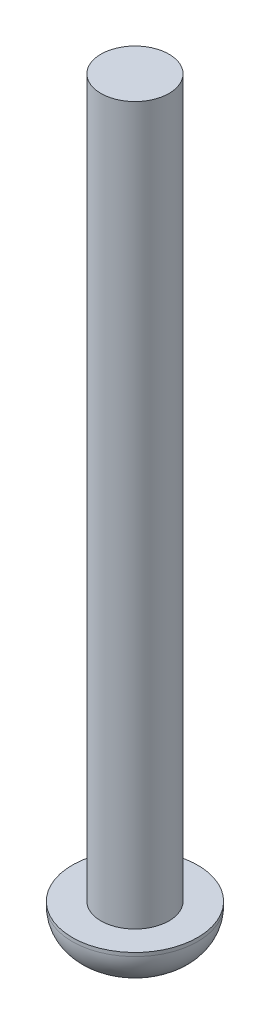
ISO-10303-21;
HEADER;
FILE_DESCRIPTION(('STEP AP214'),'2;1');
FILE_NAME('part.step','',(''),(''),'','','');
FILE_SCHEMA(('AUTOMOTIVE_DESIGN { 1 0 10303 214 1 1 1 1 }'));
ENDSEC;
DATA;
#1=APPLICATION_CONTEXT('core data for automotive mechanical design processes');
#2=APPLICATION_PROTOCOL_DEFINITION('international standard','automotive_design',2000,#1);
#3=PRODUCT_CONTEXT('',#1,'mechanical');
#4=PRODUCT('Part','Part','',(#3));
#5=PRODUCT_RELATED_PRODUCT_CATEGORY('part','',(#4));
#6=PRODUCT_DEFINITION_FORMATION('','',#4);
#7=PRODUCT_DEFINITION_CONTEXT('part definition',#1,'design');
#8=PRODUCT_DEFINITION('design','',#6,#7);
#9=PRODUCT_DEFINITION_SHAPE('','',#8);
#10=(LENGTH_UNIT() NAMED_UNIT(*) SI_UNIT(.MILLI.,.METRE.));
#11=(NAMED_UNIT(*) PLANE_ANGLE_UNIT() SI_UNIT($,.RADIAN.));
#12=(NAMED_UNIT(*) SI_UNIT($,.STERADIAN.) SOLID_ANGLE_UNIT());
#13=UNCERTAINTY_MEASURE_WITH_UNIT(LENGTH_MEASURE(1.E-05),#10,'distance_accuracy_value','');
#14=(GEOMETRIC_REPRESENTATION_CONTEXT(3) GLOBAL_UNCERTAINTY_ASSIGNED_CONTEXT((#13)) GLOBAL_UNIT_ASSIGNED_CONTEXT((#10,
#11,#12)) REPRESENTATION_CONTEXT('',''));
#15=CARTESIAN_POINT('',(0.,0.,0.));
#16=DIRECTION('',(0.,0.,1.));
#17=DIRECTION('',(1.,0.,0.));
#18=AXIS2_PLACEMENT_3D('',#15,#16,#17);
#19=CARTESIAN_POINT('',(0.,2.2,0.));
#20=DIRECTION('',(0.,-1.,0.));
#21=DIRECTION('',(0.,0.,-1.));
#22=AXIS2_PLACEMENT_3D('',#19,#20,#21);
#23=CYLINDRICAL_SURFACE('',#22,3.5);
#24=CARTESIAN_POINT('',(0.,2.,0.));
#25=DIRECTION('',(0.,1.,0.));
#26=DIRECTION('',(0.,0.,1.));
#27=AXIS2_PLACEMENT_3D('',#24,#25,#26);
#28=CIRCLE('',#27,3.5);
#29=CARTESIAN_POINT('',(0.,2.,3.5));
#30=VERTEX_POINT('',#29);
#31=EDGE_CURVE('E41',#30,#30,#28,.T.);
#32=ORIENTED_EDGE('',*,*,#31,.T.);
#33=EDGE_LOOP('',(#32));
#34=FACE_BOUND('',#33,.T.);
#35=CARTESIAN_POINT('',(0.,2.2,0.));
#36=DIRECTION('',(0.,1.,0.));
#37=DIRECTION('',(0.,0.,1.));
#38=AXIS2_PLACEMENT_3D('',#35,#36,#37);
#39=CIRCLE('',#38,3.5);
#40=CARTESIAN_POINT('',(0.,2.2,3.5));
#41=VERTEX_POINT('',#40);
#42=EDGE_CURVE('E49',#41,#41,#39,.T.);
#43=ORIENTED_EDGE('',*,*,#42,.F.);
#44=EDGE_LOOP('',(#43));
#45=FACE_BOUND('',#44,.T.);
#46=ADVANCED_FACE('F34',(#34,#45),#23,.T.);
#47=CARTESIAN_POINT('',(0.,2.2,0.));
#48=DIRECTION('',(0.,1.,0.));
#49=DIRECTION('',(0.,0.,1.));
#50=AXIS2_PLACEMENT_3D('',#47,#48,#49);
#51=PLANE('',#50);
#52=CARTESIAN_POINT('',(0.,2.2,0.));
#53=DIRECTION('',(0.,1.,0.));
#54=DIRECTION('',(0.,0.,1.));
#55=AXIS2_PLACEMENT_3D('',#52,#53,#54);
#56=CIRCLE('',#55,1.9);
#57=CARTESIAN_POINT('',(0.,2.2,1.9));
#58=VERTEX_POINT('',#57);
#59=EDGE_CURVE('E45',#58,#58,#56,.T.);
#60=ORIENTED_EDGE('',*,*,#59,.F.);
#61=EDGE_LOOP('',(#60));
#62=FACE_BOUND('',#61,.T.);
#63=ORIENTED_EDGE('',*,*,#42,.T.);
#64=EDGE_LOOP('',(#63));
#65=FACE_BOUND('',#64,.T.);
#66=ADVANCED_FACE('F67',(#62,#65),#51,.T.);
#67=CARTESIAN_POINT('',(0.,0.,0.));
#68=DIRECTION('',(0.,1.,0.));
#69=DIRECTION('',(0.,0.,1.));
#70=AXIS2_PLACEMENT_3D('',#67,#68,#69);
#71=PLANE('',#70);
#72=CARTESIAN_POINT('',(0.,0.,0.));
#73=DIRECTION('',(0.,1.,0.));
#74=DIRECTION('',(0.,0.,1.));
#75=AXIS2_PLACEMENT_3D('',#72,#73,#74);
#76=CIRCLE('',#75,1.5);
#77=CARTESIAN_POINT('',(0.,0.,1.5));
#78=VERTEX_POINT('',#77);
#79=EDGE_CURVE('E10',#78,#78,#76,.F.);
#80=ORIENTED_EDGE('',*,*,#79,.T.);
#81=EDGE_LOOP('',(#80));
#82=FACE_BOUND('',#81,.T.);
#83=ADVANCED_FACE('F63',(#82),#71,.F.);
#84=CARTESIAN_POINT('',(0.,42.2,0.));
#85=DIRECTION('',(0.,-1.,0.));
#86=DIRECTION('',(0.,0.,-1.));
#87=AXIS2_PLACEMENT_3D('',#84,#85,#86);
#88=CYLINDRICAL_SURFACE('',#87,1.9);
#89=CARTESIAN_POINT('',(0.,42.2,0.));
#90=DIRECTION('',(0.,1.,0.));
#91=DIRECTION('',(0.,0.,1.));
#92=AXIS2_PLACEMENT_3D('',#89,#90,#91);
#93=CIRCLE('',#92,1.9);
#94=CARTESIAN_POINT('',(0.,42.2,1.9));
#95=VERTEX_POINT('',#94);
#96=EDGE_CURVE('E53',#95,#95,#93,.T.);
#97=ORIENTED_EDGE('',*,*,#96,.F.);
#98=EDGE_LOOP('',(#97));
#99=FACE_BOUND('',#98,.T.);
#100=ORIENTED_EDGE('',*,*,#59,.T.);
#101=EDGE_LOOP('',(#100));
#102=FACE_BOUND('',#101,.T.);
#103=ADVANCED_FACE('F60',(#99,#102),#88,.T.);
#104=CARTESIAN_POINT('',(0.,42.2,0.));
#105=DIRECTION('',(0.,1.,0.));
#106=DIRECTION('',(0.,0.,1.));
#107=AXIS2_PLACEMENT_3D('',#104,#105,#106);
#108=PLANE('',#107);
#109=ORIENTED_EDGE('',*,*,#96,.T.);
#110=EDGE_LOOP('',(#109));
#111=FACE_BOUND('',#110,.T.);
#112=ADVANCED_FACE('F58',(#111),#108,.T.);
#113=CARTESIAN_POINT('',(0.,2.,0.));
#114=DIRECTION('',(0.,1.,0.));
#115=DIRECTION('',(0.,0.,1.));
#116=AXIS2_PLACEMENT_3D('',#113,#114,#115);
#117=DEGENERATE_TOROIDAL_SURFACE('',#116,1.5,2.,.T.);
#118=ORIENTED_EDGE('',*,*,#79,.F.);
#119=EDGE_LOOP('',(#118));
#120=FACE_BOUND('',#119,.T.);
#121=ORIENTED_EDGE('',*,*,#31,.F.);
#122=EDGE_LOOP('',(#121));
#123=FACE_BOUND('',#122,.T.);
#124=ADVANCED_FACE('F36',(#120,#123),#117,.T.);
#125=CLOSED_SHELL('',(#46,#66,#83,#103,#112,#124));
#126=MANIFOLD_SOLID_BREP('B2',#125);
#127=ADVANCED_BREP_SHAPE_REPRESENTATION('',(#18,#126),#14);
#128=SHAPE_DEFINITION_REPRESENTATION(#9,#127);
ENDSEC;
END-ISO-10303-21;
